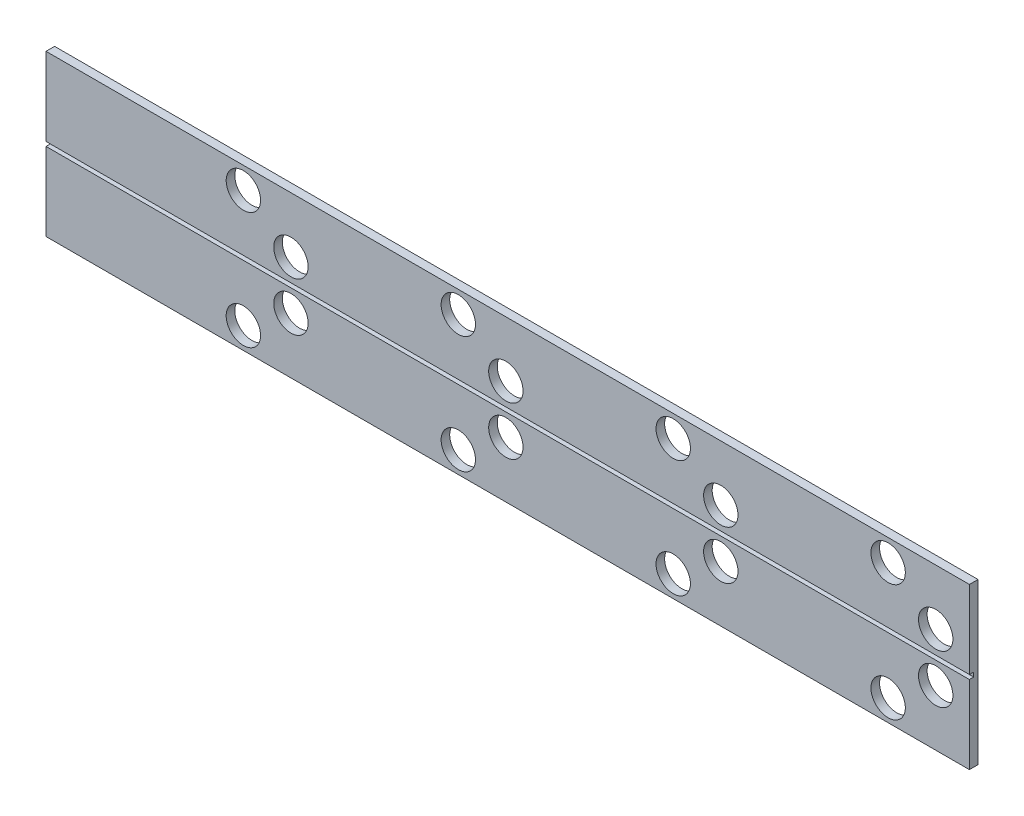
ISO-10303-21;
HEADER;
FILE_DESCRIPTION(('STEP AP214'),'2;1');
FILE_NAME('part.step','',(''),(''),'','','');
FILE_SCHEMA(('AUTOMOTIVE_DESIGN { 1 0 10303 214 1 1 1 1 }'));
ENDSEC;
DATA;
#1=APPLICATION_CONTEXT('core data for automotive mechanical design processes');
#2=APPLICATION_PROTOCOL_DEFINITION('international standard','automotive_design',2000,#1);
#3=PRODUCT_CONTEXT('',#1,'mechanical');
#4=PRODUCT('Part','Part','',(#3));
#5=PRODUCT_RELATED_PRODUCT_CATEGORY('part','',(#4));
#6=PRODUCT_DEFINITION_FORMATION('','',#4);
#7=PRODUCT_DEFINITION_CONTEXT('part definition',#1,'design');
#8=PRODUCT_DEFINITION('design','',#6,#7);
#9=PRODUCT_DEFINITION_SHAPE('','',#8);
#10=(LENGTH_UNIT() NAMED_UNIT(*) SI_UNIT(.MILLI.,.METRE.));
#11=(NAMED_UNIT(*) PLANE_ANGLE_UNIT() SI_UNIT($,.RADIAN.));
#12=(NAMED_UNIT(*) SI_UNIT($,.STERADIAN.) SOLID_ANGLE_UNIT());
#13=UNCERTAINTY_MEASURE_WITH_UNIT(LENGTH_MEASURE(1.E-05),#10,'distance_accuracy_value','');
#14=(GEOMETRIC_REPRESENTATION_CONTEXT(3) GLOBAL_UNCERTAINTY_ASSIGNED_CONTEXT((#13)) GLOBAL_UNIT_ASSIGNED_CONTEXT((#10,
#11,#12)) REPRESENTATION_CONTEXT('',''));
#15=CARTESIAN_POINT('',(0.,0.,0.));
#16=DIRECTION('',(0.,0.,1.));
#17=DIRECTION('',(1.,0.,0.));
#18=AXIS2_PLACEMENT_3D('',#15,#16,#17);
#19=CARTESIAN_POINT('',(0.,0.,0.2));
#20=DIRECTION('',(0.,0.,1.));
#21=DIRECTION('',(1.,0.,0.));
#22=AXIS2_PLACEMENT_3D('',#19,#20,#21);
#23=PLANE('',#22);
#24=CARTESIAN_POINT('',(-6.14935824448216,1.35966981169838,0.2));
#25=DIRECTION('',(0.,0.,1.));
#26=DIRECTION('',(1.,0.,0.));
#27=AXIS2_PLACEMENT_3D('',#24,#25,#26);
#28=CIRCLE('',#27,0.400000000000001);
#29=CARTESIAN_POINT('',(-5.74935824448216,1.35966981169838,0.2));
#30=VERTEX_POINT('',#29);
#31=EDGE_CURVE('E485',#30,#30,#28,.T.);
#32=ORIENTED_EDGE('',*,*,#31,.F.);
#33=EDGE_LOOP('',(#32));
#34=FACE_BOUND('',#33,.T.);
#35=CARTESIAN_POINT('',(-5.04281811205357,0.571259967343007,0.2));
#36=DIRECTION('',(0.,0.,1.));
#37=DIRECTION('',(1.,0.,0.));
#38=AXIS2_PLACEMENT_3D('',#35,#36,#37);
#39=CIRCLE('',#38,0.4);
#40=CARTESIAN_POINT('',(-4.64281811205357,0.571259967343007,0.2));
#41=VERTEX_POINT('',#40);
#42=EDGE_CURVE('E487',#41,#41,#39,.T.);
#43=ORIENTED_EDGE('',*,*,#42,.F.);
#44=EDGE_LOOP('',(#43));
#45=FACE_BOUND('',#44,.T.);
#46=CARTESIAN_POINT('',(-1.14935824448216,1.35966981169838,0.2));
#47=DIRECTION('',(0.,0.,1.));
#48=DIRECTION('',(1.,0.,0.));
#49=AXIS2_PLACEMENT_3D('',#46,#47,#48);
#50=CIRCLE('',#49,0.400000000000001);
#51=CARTESIAN_POINT('',(-0.749358244482159,1.35966981169838,0.2));
#52=VERTEX_POINT('',#51);
#53=EDGE_CURVE('E499',#52,#52,#50,.T.);
#54=ORIENTED_EDGE('',*,*,#53,.F.);
#55=EDGE_LOOP('',(#54));
#56=FACE_BOUND('',#55,.T.);
#57=CARTESIAN_POINT('',(-0.0428181120535696,0.571259967343007,0.2));
#58=DIRECTION('',(0.,0.,1.));
#59=DIRECTION('',(1.,0.,0.));
#60=AXIS2_PLACEMENT_3D('',#57,#58,#59);
#61=CIRCLE('',#60,0.4);
#62=CARTESIAN_POINT('',(0.35718188794643,0.571259967343007,0.2));
#63=VERTEX_POINT('',#62);
#64=EDGE_CURVE('E503',#63,#63,#61,.T.);
#65=ORIENTED_EDGE('',*,*,#64,.F.);
#66=EDGE_LOOP('',(#65));
#67=FACE_BOUND('',#66,.T.);
#68=CARTESIAN_POINT('',(3.85064175551784,1.35966981169838,0.2));
#69=DIRECTION('',(0.,0.,1.));
#70=DIRECTION('',(1.,0.,0.));
#71=AXIS2_PLACEMENT_3D('',#68,#69,#70);
#72=CIRCLE('',#71,0.400000000000001);
#73=CARTESIAN_POINT('',(4.25064175551784,1.35966981169838,0.2));
#74=VERTEX_POINT('',#73);
#75=EDGE_CURVE('E515',#74,#74,#72,.T.);
#76=ORIENTED_EDGE('',*,*,#75,.F.);
#77=EDGE_LOOP('',(#76));
#78=FACE_BOUND('',#77,.T.);
#79=CARTESIAN_POINT('',(4.95718188794643,0.571259967343007,0.2));
#80=DIRECTION('',(0.,0.,1.));
#81=DIRECTION('',(1.,0.,0.));
#82=AXIS2_PLACEMENT_3D('',#79,#80,#81);
#83=CIRCLE('',#82,0.4);
#84=CARTESIAN_POINT('',(5.35718188794643,0.571259967343007,0.2));
#85=VERTEX_POINT('',#84);
#86=EDGE_CURVE('E519',#85,#85,#83,.T.);
#87=ORIENTED_EDGE('',*,*,#86,.F.);
#88=EDGE_LOOP('',(#87));
#89=FACE_BOUND('',#88,.T.);
#90=CARTESIAN_POINT('',(8.85064175551784,1.35966981169838,0.2));
#91=DIRECTION('',(0.,0.,1.));
#92=DIRECTION('',(1.,0.,0.));
#93=AXIS2_PLACEMENT_3D('',#90,#91,#92);
#94=CIRCLE('',#93,0.400000000000001);
#95=CARTESIAN_POINT('',(9.25064175551784,1.35966981169838,0.2));
#96=VERTEX_POINT('',#95);
#97=EDGE_CURVE('E531',#96,#96,#94,.T.);
#98=ORIENTED_EDGE('',*,*,#97,.F.);
#99=EDGE_LOOP('',(#98));
#100=FACE_BOUND('',#99,.T.);
#101=CARTESIAN_POINT('',(9.95718188794643,0.571259967343007,0.2));
#102=DIRECTION('',(0.,0.,1.));
#103=DIRECTION('',(1.,0.,0.));
#104=AXIS2_PLACEMENT_3D('',#101,#102,#103);
#105=CIRCLE('',#104,0.4);
#106=CARTESIAN_POINT('',(10.3571818879464,0.571259967343007,0.2));
#107=VERTEX_POINT('',#106);
#108=EDGE_CURVE('E535',#107,#107,#105,.T.);
#109=ORIENTED_EDGE('',*,*,#108,.F.);
#110=EDGE_LOOP('',(#109));
#111=FACE_BOUND('',#110,.T.);
#112=DIRECTION('',(-1.,0.,0.));
#113=VECTOR('',#112,1.);
#114=CARTESIAN_POINT('',(10.7410625976883,0.05,0.2));
#115=LINE('',#114,#113);
#116=CARTESIAN_POINT('',(10.7410625976883,0.05,0.2));
#117=VERTEX_POINT('',#116);
#118=CARTESIAN_POINT('',(-10.7410625976883,0.05,0.2));
#119=VERTEX_POINT('',#118);
#120=EDGE_CURVE('E124',#117,#119,#115,.T.);
#121=ORIENTED_EDGE('',*,*,#120,.F.);
#122=DIRECTION('',(0.,1.,0.));
#123=VECTOR('',#122,1.);
#124=CARTESIAN_POINT('',(10.7410625976883,1.86597544762487,0.2));
#125=LINE('',#124,#123);
#126=CARTESIAN_POINT('',(10.7410625976883,1.86597544762487,0.2));
#127=VERTEX_POINT('',#126);
#128=EDGE_CURVE('E86',#117,#127,#125,.T.);
#129=ORIENTED_EDGE('',*,*,#128,.T.);
#130=DIRECTION('',(-1.,0.,0.));
#131=VECTOR('',#130,1.);
#132=CARTESIAN_POINT('',(-10.7410625976883,1.86597544762487,0.2));
#133=LINE('',#132,#131);
#134=CARTESIAN_POINT('',(-10.7410625976883,1.86597544762487,0.2));
#135=VERTEX_POINT('',#134);
#136=EDGE_CURVE('E138',#127,#135,#133,.T.);
#137=ORIENTED_EDGE('',*,*,#136,.T.);
#138=DIRECTION('',(0.,-1.,0.));
#139=VECTOR('',#138,1.);
#140=CARTESIAN_POINT('',(-10.7410625976883,1.86597544762487,0.2));
#141=LINE('',#140,#139);
#142=EDGE_CURVE('E140',#135,#119,#141,.T.);
#143=ORIENTED_EDGE('',*,*,#142,.T.);
#144=EDGE_LOOP('',(#121,#129,#137,#143));
#145=FACE_BOUND('',#144,.T.);
#146=ADVANCED_FACE('F33',(#34,#45,#56,#67,#78,#89,#100,#111,#145),#23,.T.);
#147=CARTESIAN_POINT('',(10.7410625976883,1.86597544762487,0.2));
#148=DIRECTION('',(-1.,0.,0.));
#149=DIRECTION('',(0.,0.,1.));
#150=AXIS2_PLACEMENT_3D('',#147,#148,#149);
#151=PLANE('',#150);
#152=ORIENTED_EDGE('',*,*,#128,.F.);
#153=DIRECTION('',(0.,0.,1.));
#154=VECTOR('',#153,1.);
#155=CARTESIAN_POINT('',(10.7410625976883,0.05,0.1));
#156=LINE('',#155,#154);
#157=CARTESIAN_POINT('',(10.7410625976883,0.05,0.1));
#158=VERTEX_POINT('',#157);
#159=EDGE_CURVE('E131',#158,#117,#156,.T.);
#160=ORIENTED_EDGE('',*,*,#159,.F.);
#161=DIRECTION('',(0.,1.,0.));
#162=VECTOR('',#161,1.);
#163=CARTESIAN_POINT('',(10.7410625976883,-0.05,0.1));
#164=LINE('',#163,#162);
#165=CARTESIAN_POINT('',(10.7410625976883,-0.05,0.1));
#166=VERTEX_POINT('',#165);
#167=EDGE_CURVE('E114',#166,#158,#164,.T.);
#168=ORIENTED_EDGE('',*,*,#167,.F.);
#169=DIRECTION('',(0.,0.,1.));
#170=VECTOR('',#169,1.);
#171=CARTESIAN_POINT('',(10.7410625976883,-0.05,0.1));
#172=LINE('',#171,#170);
#173=CARTESIAN_POINT('',(10.7410625976883,-0.05,0.2));
#174=VERTEX_POINT('',#173);
#175=EDGE_CURVE('E111',#166,#174,#172,.T.);
#176=ORIENTED_EDGE('',*,*,#175,.T.);
#177=CARTESIAN_POINT('',(10.7410625976883,-1.86597544762487,0.2));
#178=VERTEX_POINT('',#177);
#179=EDGE_CURVE('E136',#178,#174,#125,.T.);
#180=ORIENTED_EDGE('',*,*,#179,.F.);
#181=DIRECTION('',(0.,0.,-1.));
#182=VECTOR('',#181,1.);
#183=CARTESIAN_POINT('',(10.7410625976883,-1.86597544762487,0.2));
#184=LINE('',#183,#182);
#185=CARTESIAN_POINT('',(10.7410625976883,-1.86597544762487,0.));
#186=VERTEX_POINT('',#185);
#187=EDGE_CURVE('E144',#178,#186,#184,.T.);
#188=ORIENTED_EDGE('',*,*,#187,.T.);
#189=DIRECTION('',(0.,1.,0.));
#190=VECTOR('',#189,1.);
#191=CARTESIAN_POINT('',(10.7410625976883,1.86597544762487,0.));
#192=LINE('',#191,#190);
#193=CARTESIAN_POINT('',(10.7410625976883,1.86597544762487,0.));
#194=VERTEX_POINT('',#193);
#195=EDGE_CURVE('E145',#186,#194,#192,.T.);
#196=ORIENTED_EDGE('',*,*,#195,.T.);
#197=DIRECTION('',(0.,0.,-1.));
#198=VECTOR('',#197,1.);
#199=CARTESIAN_POINT('',(10.7410625976883,1.86597544762487,0.2));
#200=LINE('',#199,#198);
#201=EDGE_CURVE('E11',#127,#194,#200,.T.);
#202=ORIENTED_EDGE('',*,*,#201,.F.);
#203=EDGE_LOOP('',(#152,#160,#168,#176,#180,#188,#196,#202));
#204=FACE_BOUND('',#203,.T.);
#205=ADVANCED_FACE('F35',(#204),#151,.F.);
#206=CARTESIAN_POINT('',(-10.7410625976883,1.86597544762487,0.2));
#207=DIRECTION('',(0.,-1.,0.));
#208=DIRECTION('',(0.,0.,-1.));
#209=AXIS2_PLACEMENT_3D('',#206,#207,#208);
#210=PLANE('',#209);
#211=DIRECTION('',(-1.,0.,0.));
#212=VECTOR('',#211,1.);
#213=CARTESIAN_POINT('',(-10.7410625976883,1.86597544762487,0.));
#214=LINE('',#213,#212);
#215=CARTESIAN_POINT('',(-10.7410625976883,1.86597544762487,0.));
#216=VERTEX_POINT('',#215);
#217=EDGE_CURVE('E148',#194,#216,#214,.T.);
#218=ORIENTED_EDGE('',*,*,#217,.T.);
#219=DIRECTION('',(0.,0.,-1.));
#220=VECTOR('',#219,1.);
#221=CARTESIAN_POINT('',(-10.7410625976883,1.86597544762487,0.2));
#222=LINE('',#221,#220);
#223=EDGE_CURVE('E41',#135,#216,#222,.T.);
#224=ORIENTED_EDGE('',*,*,#223,.F.);
#225=ORIENTED_EDGE('',*,*,#136,.F.);
#226=ORIENTED_EDGE('',*,*,#201,.T.);
#227=EDGE_LOOP('',(#218,#224,#225,#226));
#228=FACE_BOUND('',#227,.T.);
#229=ADVANCED_FACE('F177',(#228),#210,.F.);
#230=CARTESIAN_POINT('',(-10.7410625976883,1.86597544762487,0.2));
#231=DIRECTION('',(1.,0.,0.));
#232=DIRECTION('',(0.,0.,-1.));
#233=AXIS2_PLACEMENT_3D('',#230,#231,#232);
#234=PLANE('',#233);
#235=DIRECTION('',(0.,-1.,0.));
#236=VECTOR('',#235,1.);
#237=CARTESIAN_POINT('',(-10.7410625976883,-0.05,0.1));
#238=LINE('',#237,#236);
#239=CARTESIAN_POINT('',(-10.7410625976883,0.05,0.1));
#240=VERTEX_POINT('',#239);
#241=CARTESIAN_POINT('',(-10.7410625976883,-0.05,0.1));
#242=VERTEX_POINT('',#241);
#243=EDGE_CURVE('E115',#240,#242,#238,.T.);
#244=ORIENTED_EDGE('',*,*,#243,.F.);
#245=DIRECTION('',(0.,0.,1.));
#246=VECTOR('',#245,1.);
#247=CARTESIAN_POINT('',(-10.7410625976883,0.05,0.1));
#248=LINE('',#247,#246);
#249=EDGE_CURVE('E149',#240,#119,#248,.T.);
#250=ORIENTED_EDGE('',*,*,#249,.T.);
#251=ORIENTED_EDGE('',*,*,#142,.F.);
#252=ORIENTED_EDGE('',*,*,#223,.T.);
#253=DIRECTION('',(0.,-1.,0.));
#254=VECTOR('',#253,1.);
#255=CARTESIAN_POINT('',(-10.7410625976883,1.86597544762487,0.));
#256=LINE('',#255,#254);
#257=CARTESIAN_POINT('',(-10.7410625976883,-1.86597544762487,0.));
#258=VERTEX_POINT('',#257);
#259=EDGE_CURVE('E151',#216,#258,#256,.T.);
#260=ORIENTED_EDGE('',*,*,#259,.T.);
#261=DIRECTION('',(0.,0.,-1.));
#262=VECTOR('',#261,1.);
#263=CARTESIAN_POINT('',(-10.7410625976883,-1.86597544762487,0.2));
#264=LINE('',#263,#262);
#265=CARTESIAN_POINT('',(-10.7410625976883,-1.86597544762487,0.2));
#266=VERTEX_POINT('',#265);
#267=EDGE_CURVE('E155',#266,#258,#264,.T.);
#268=ORIENTED_EDGE('',*,*,#267,.F.);
#269=CARTESIAN_POINT('',(-10.7410625976883,-0.0499999999999999,0.2));
#270=VERTEX_POINT('',#269);
#271=EDGE_CURVE('E129',#270,#266,#141,.T.);
#272=ORIENTED_EDGE('',*,*,#271,.F.);
#273=DIRECTION('',(0.,0.,1.));
#274=VECTOR('',#273,1.);
#275=CARTESIAN_POINT('',(-10.7410625976883,-0.05,0.1));
#276=LINE('',#275,#274);
#277=EDGE_CURVE('E48',#242,#270,#276,.T.);
#278=ORIENTED_EDGE('',*,*,#277,.F.);
#279=EDGE_LOOP('',(#244,#250,#251,#252,#260,#268,#272,#278));
#280=FACE_BOUND('',#279,.T.);
#281=ADVANCED_FACE('F127',(#280),#234,.F.);
#282=CARTESIAN_POINT('',(-10.7410625976883,-1.86597544762487,0.2));
#283=DIRECTION('',(0.,1.,0.));
#284=DIRECTION('',(0.,0.,1.));
#285=AXIS2_PLACEMENT_3D('',#282,#283,#284);
#286=PLANE('',#285);
#287=DIRECTION('',(1.,0.,0.));
#288=VECTOR('',#287,1.);
#289=CARTESIAN_POINT('',(-10.7410625976883,-1.86597544762487,0.));
#290=LINE('',#289,#288);
#291=EDGE_CURVE('E78',#258,#186,#290,.T.);
#292=ORIENTED_EDGE('',*,*,#291,.T.);
#293=ORIENTED_EDGE('',*,*,#187,.F.);
#294=DIRECTION('',(1.,0.,0.));
#295=VECTOR('',#294,1.);
#296=CARTESIAN_POINT('',(-10.7410625976883,-1.86597544762487,0.2));
#297=LINE('',#296,#295);
#298=EDGE_CURVE('E57',#266,#178,#297,.T.);
#299=ORIENTED_EDGE('',*,*,#298,.F.);
#300=ORIENTED_EDGE('',*,*,#267,.T.);
#301=EDGE_LOOP('',(#292,#293,#299,#300));
#302=FACE_BOUND('',#301,.T.);
#303=ADVANCED_FACE('F167',(#302),#286,.F.);
#304=CARTESIAN_POINT('',(-6.14935824448216,-1.36518526440703,0.2));
#305=DIRECTION('',(0.,0.,1.));
#306=DIRECTION('',(1.,0.,0.));
#307=AXIS2_PLACEMENT_3D('',#304,#305,#306);
#308=CIRCLE('',#307,0.400000000000001);
#309=CARTESIAN_POINT('',(-5.74935824448216,-1.36518526440703,0.2));
#310=VERTEX_POINT('',#309);
#311=EDGE_CURVE('E491',#310,#310,#308,.T.);
#312=ORIENTED_EDGE('',*,*,#311,.F.);
#313=EDGE_LOOP('',(#312));
#314=FACE_BOUND('',#313,.T.);
#315=CARTESIAN_POINT('',(-5.04281811205357,-0.562943668396298,0.2));
#316=DIRECTION('',(0.,0.,1.));
#317=DIRECTION('',(1.,0.,0.));
#318=AXIS2_PLACEMENT_3D('',#315,#316,#317);
#319=CIRCLE('',#318,0.4);
#320=CARTESIAN_POINT('',(-4.64281811205357,-0.562943668396298,0.2));
#321=VERTEX_POINT('',#320);
#322=EDGE_CURVE('E495',#321,#321,#319,.T.);
#323=ORIENTED_EDGE('',*,*,#322,.F.);
#324=EDGE_LOOP('',(#323));
#325=FACE_BOUND('',#324,.T.);
#326=CARTESIAN_POINT('',(-1.14935824448216,-1.36518526440703,0.2));
#327=DIRECTION('',(0.,0.,1.));
#328=DIRECTION('',(1.,0.,0.));
#329=AXIS2_PLACEMENT_3D('',#326,#327,#328);
#330=CIRCLE('',#329,0.400000000000001);
#331=CARTESIAN_POINT('',(-0.749358244482159,-1.36518526440703,0.2));
#332=VERTEX_POINT('',#331);
#333=EDGE_CURVE('E507',#332,#332,#330,.T.);
#334=ORIENTED_EDGE('',*,*,#333,.F.);
#335=EDGE_LOOP('',(#334));
#336=FACE_BOUND('',#335,.T.);
#337=CARTESIAN_POINT('',(-0.0428181120535696,-0.562943668396298,0.2));
#338=DIRECTION('',(0.,0.,1.));
#339=DIRECTION('',(1.,0.,0.));
#340=AXIS2_PLACEMENT_3D('',#337,#338,#339);
#341=CIRCLE('',#340,0.4);
#342=CARTESIAN_POINT('',(0.35718188794643,-0.562943668396298,0.2));
#343=VERTEX_POINT('',#342);
#344=EDGE_CURVE('E511',#343,#343,#341,.T.);
#345=ORIENTED_EDGE('',*,*,#344,.F.);
#346=EDGE_LOOP('',(#345));
#347=FACE_BOUND('',#346,.T.);
#348=CARTESIAN_POINT('',(3.85064175551784,-1.36518526440703,0.2));
#349=DIRECTION('',(0.,0.,1.));
#350=DIRECTION('',(1.,0.,0.));
#351=AXIS2_PLACEMENT_3D('',#348,#349,#350);
#352=CIRCLE('',#351,0.400000000000001);
#353=CARTESIAN_POINT('',(4.25064175551784,-1.36518526440703,0.2));
#354=VERTEX_POINT('',#353);
#355=EDGE_CURVE('E523',#354,#354,#352,.T.);
#356=ORIENTED_EDGE('',*,*,#355,.F.);
#357=EDGE_LOOP('',(#356));
#358=FACE_BOUND('',#357,.T.);
#359=CARTESIAN_POINT('',(4.95718188794643,-0.562943668396298,0.2));
#360=DIRECTION('',(0.,0.,1.));
#361=DIRECTION('',(1.,0.,0.));
#362=AXIS2_PLACEMENT_3D('',#359,#360,#361);
#363=CIRCLE('',#362,0.4);
#364=CARTESIAN_POINT('',(5.35718188794643,-0.562943668396298,0.2));
#365=VERTEX_POINT('',#364);
#366=EDGE_CURVE('E527',#365,#365,#363,.T.);
#367=ORIENTED_EDGE('',*,*,#366,.F.);
#368=EDGE_LOOP('',(#367));
#369=FACE_BOUND('',#368,.T.);
#370=CARTESIAN_POINT('',(8.85064175551784,-1.36518526440703,0.2));
#371=DIRECTION('',(0.,0.,1.));
#372=DIRECTION('',(1.,0.,0.));
#373=AXIS2_PLACEMENT_3D('',#370,#371,#372);
#374=CIRCLE('',#373,0.400000000000001);
#375=CARTESIAN_POINT('',(9.25064175551784,-1.36518526440703,0.2));
#376=VERTEX_POINT('',#375);
#377=EDGE_CURVE('E267',#376,#376,#374,.T.);
#378=ORIENTED_EDGE('',*,*,#377,.F.);
#379=EDGE_LOOP('',(#378));
#380=FACE_BOUND('',#379,.T.);
#381=CARTESIAN_POINT('',(9.95718188794643,-0.562943668396298,0.2));
#382=DIRECTION('',(0.,0.,1.));
#383=DIRECTION('',(1.,0.,0.));
#384=AXIS2_PLACEMENT_3D('',#381,#382,#383);
#385=CIRCLE('',#384,0.4);
#386=CARTESIAN_POINT('',(10.3571818879464,-0.562943668396298,0.2));
#387=VERTEX_POINT('',#386);
#388=EDGE_CURVE('E261',#387,#387,#385,.T.);
#389=ORIENTED_EDGE('',*,*,#388,.F.);
#390=EDGE_LOOP('',(#389));
#391=FACE_BOUND('',#390,.T.);
#392=DIRECTION('',(1.,0.,0.));
#393=VECTOR('',#392,1.);
#394=CARTESIAN_POINT('',(10.7410625976883,-0.05,0.2));
#395=LINE('',#394,#393);
#396=EDGE_CURVE('E260',#270,#174,#395,.T.);
#397=ORIENTED_EDGE('',*,*,#396,.F.);
#398=ORIENTED_EDGE('',*,*,#271,.T.);
#399=ORIENTED_EDGE('',*,*,#298,.T.);
#400=ORIENTED_EDGE('',*,*,#179,.T.);
#401=EDGE_LOOP('',(#397,#398,#399,#400));
#402=FACE_BOUND('',#401,.T.);
#403=ADVANCED_FACE('F169',(#314,#325,#336,#347,#358,#369,#380,#391,#402),#23,.T.);
#404=CARTESIAN_POINT('',(0.,0.,0.));
#405=DIRECTION('',(0.,0.,1.));
#406=DIRECTION('',(1.,0.,0.));
#407=AXIS2_PLACEMENT_3D('',#404,#405,#406);
#408=PLANE('',#407);
#409=CARTESIAN_POINT('',(-6.14935824448216,1.35966981169838,0.));
#410=DIRECTION('',(0.,0.,1.));
#411=DIRECTION('',(1.,0.,0.));
#412=AXIS2_PLACEMENT_3D('',#409,#410,#411);
#413=CIRCLE('',#412,0.400000000000001);
#414=CARTESIAN_POINT('',(-5.74935824448216,1.35966981169838,0.));
#415=VERTEX_POINT('',#414);
#416=EDGE_CURVE('E199',#415,#415,#413,.T.);
#417=ORIENTED_EDGE('',*,*,#416,.T.);
#418=EDGE_LOOP('',(#417));
#419=FACE_BOUND('',#418,.T.);
#420=CARTESIAN_POINT('',(-5.04281811205357,0.571259967343007,0.));
#421=DIRECTION('',(0.,0.,1.));
#422=DIRECTION('',(1.,0.,0.));
#423=AXIS2_PLACEMENT_3D('',#420,#421,#422);
#424=CIRCLE('',#423,0.4);
#425=CARTESIAN_POINT('',(-4.64281811205357,0.571259967343007,0.));
#426=VERTEX_POINT('',#425);
#427=EDGE_CURVE('E203',#426,#426,#424,.T.);
#428=ORIENTED_EDGE('',*,*,#427,.T.);
#429=EDGE_LOOP('',(#428));
#430=FACE_BOUND('',#429,.T.);
#431=CARTESIAN_POINT('',(-6.14935824448216,-1.36518526440703,0.));
#432=DIRECTION('',(0.,0.,1.));
#433=DIRECTION('',(1.,0.,0.));
#434=AXIS2_PLACEMENT_3D('',#431,#432,#433);
#435=CIRCLE('',#434,0.400000000000001);
#436=CARTESIAN_POINT('',(-5.74935824448216,-1.36518526440703,0.));
#437=VERTEX_POINT('',#436);
#438=EDGE_CURVE('E207',#437,#437,#435,.T.);
#439=ORIENTED_EDGE('',*,*,#438,.T.);
#440=EDGE_LOOP('',(#439));
#441=FACE_BOUND('',#440,.T.);
#442=CARTESIAN_POINT('',(-5.04281811205357,-0.562943668396298,0.));
#443=DIRECTION('',(0.,0.,1.));
#444=DIRECTION('',(1.,0.,0.));
#445=AXIS2_PLACEMENT_3D('',#442,#443,#444);
#446=CIRCLE('',#445,0.4);
#447=CARTESIAN_POINT('',(-4.64281811205357,-0.562943668396298,0.));
#448=VERTEX_POINT('',#447);
#449=EDGE_CURVE('E211',#448,#448,#446,.T.);
#450=ORIENTED_EDGE('',*,*,#449,.T.);
#451=EDGE_LOOP('',(#450));
#452=FACE_BOUND('',#451,.T.);
#453=CARTESIAN_POINT('',(-1.14935824448216,1.35966981169838,0.));
#454=DIRECTION('',(0.,0.,1.));
#455=DIRECTION('',(1.,0.,0.));
#456=AXIS2_PLACEMENT_3D('',#453,#454,#455);
#457=CIRCLE('',#456,0.400000000000001);
#458=CARTESIAN_POINT('',(-0.749358244482159,1.35966981169838,0.));
#459=VERTEX_POINT('',#458);
#460=EDGE_CURVE('E215',#459,#459,#457,.T.);
#461=ORIENTED_EDGE('',*,*,#460,.T.);
#462=EDGE_LOOP('',(#461));
#463=FACE_BOUND('',#462,.T.);
#464=CARTESIAN_POINT('',(-0.0428181120535696,0.571259967343007,0.));
#465=DIRECTION('',(0.,0.,1.));
#466=DIRECTION('',(1.,0.,0.));
#467=AXIS2_PLACEMENT_3D('',#464,#465,#466);
#468=CIRCLE('',#467,0.4);
#469=CARTESIAN_POINT('',(0.35718188794643,0.571259967343007,0.));
#470=VERTEX_POINT('',#469);
#471=EDGE_CURVE('E219',#470,#470,#468,.T.);
#472=ORIENTED_EDGE('',*,*,#471,.T.);
#473=EDGE_LOOP('',(#472));
#474=FACE_BOUND('',#473,.T.);
#475=CARTESIAN_POINT('',(-1.14935824448216,-1.36518526440703,0.));
#476=DIRECTION('',(0.,0.,1.));
#477=DIRECTION('',(1.,0.,0.));
#478=AXIS2_PLACEMENT_3D('',#475,#476,#477);
#479=CIRCLE('',#478,0.400000000000001);
#480=CARTESIAN_POINT('',(-0.749358244482159,-1.36518526440703,0.));
#481=VERTEX_POINT('',#480);
#482=EDGE_CURVE('E223',#481,#481,#479,.T.);
#483=ORIENTED_EDGE('',*,*,#482,.T.);
#484=EDGE_LOOP('',(#483));
#485=FACE_BOUND('',#484,.T.);
#486=CARTESIAN_POINT('',(-0.0428181120535696,-0.562943668396298,0.));
#487=DIRECTION('',(0.,0.,1.));
#488=DIRECTION('',(1.,0.,0.));
#489=AXIS2_PLACEMENT_3D('',#486,#487,#488);
#490=CIRCLE('',#489,0.4);
#491=CARTESIAN_POINT('',(0.35718188794643,-0.562943668396298,0.));
#492=VERTEX_POINT('',#491);
#493=EDGE_CURVE('E227',#492,#492,#490,.T.);
#494=ORIENTED_EDGE('',*,*,#493,.T.);
#495=EDGE_LOOP('',(#494));
#496=FACE_BOUND('',#495,.T.);
#497=CARTESIAN_POINT('',(3.85064175551784,1.35966981169838,0.));
#498=DIRECTION('',(0.,0.,1.));
#499=DIRECTION('',(1.,0.,0.));
#500=AXIS2_PLACEMENT_3D('',#497,#498,#499);
#501=CIRCLE('',#500,0.400000000000001);
#502=CARTESIAN_POINT('',(4.25064175551784,1.35966981169838,0.));
#503=VERTEX_POINT('',#502);
#504=EDGE_CURVE('E231',#503,#503,#501,.T.);
#505=ORIENTED_EDGE('',*,*,#504,.T.);
#506=EDGE_LOOP('',(#505));
#507=FACE_BOUND('',#506,.T.);
#508=CARTESIAN_POINT('',(4.95718188794643,0.571259967343007,0.));
#509=DIRECTION('',(0.,0.,1.));
#510=DIRECTION('',(1.,0.,0.));
#511=AXIS2_PLACEMENT_3D('',#508,#509,#510);
#512=CIRCLE('',#511,0.4);
#513=CARTESIAN_POINT('',(5.35718188794643,0.571259967343007,0.));
#514=VERTEX_POINT('',#513);
#515=EDGE_CURVE('E235',#514,#514,#512,.T.);
#516=ORIENTED_EDGE('',*,*,#515,.T.);
#517=EDGE_LOOP('',(#516));
#518=FACE_BOUND('',#517,.T.);
#519=CARTESIAN_POINT('',(3.85064175551784,-1.36518526440703,0.));
#520=DIRECTION('',(0.,0.,1.));
#521=DIRECTION('',(1.,0.,0.));
#522=AXIS2_PLACEMENT_3D('',#519,#520,#521);
#523=CIRCLE('',#522,0.400000000000001);
#524=CARTESIAN_POINT('',(4.25064175551784,-1.36518526440703,0.));
#525=VERTEX_POINT('',#524);
#526=EDGE_CURVE('E239',#525,#525,#523,.T.);
#527=ORIENTED_EDGE('',*,*,#526,.T.);
#528=EDGE_LOOP('',(#527));
#529=FACE_BOUND('',#528,.T.);
#530=CARTESIAN_POINT('',(4.95718188794643,-0.562943668396298,0.));
#531=DIRECTION('',(0.,0.,1.));
#532=DIRECTION('',(1.,0.,0.));
#533=AXIS2_PLACEMENT_3D('',#530,#531,#532);
#534=CIRCLE('',#533,0.4);
#535=CARTESIAN_POINT('',(5.35718188794643,-0.562943668396298,0.));
#536=VERTEX_POINT('',#535);
#537=EDGE_CURVE('E243',#536,#536,#534,.T.);
#538=ORIENTED_EDGE('',*,*,#537,.T.);
#539=EDGE_LOOP('',(#538));
#540=FACE_BOUND('',#539,.T.);
#541=CARTESIAN_POINT('',(8.85064175551784,1.35966981169838,0.));
#542=DIRECTION('',(0.,0.,1.));
#543=DIRECTION('',(1.,0.,0.));
#544=AXIS2_PLACEMENT_3D('',#541,#542,#543);
#545=CIRCLE('',#544,0.400000000000001);
#546=CARTESIAN_POINT('',(9.25064175551784,1.35966981169838,0.));
#547=VERTEX_POINT('',#546);
#548=EDGE_CURVE('E247',#547,#547,#545,.T.);
#549=ORIENTED_EDGE('',*,*,#548,.T.);
#550=EDGE_LOOP('',(#549));
#551=FACE_BOUND('',#550,.T.);
#552=CARTESIAN_POINT('',(9.95718188794643,0.571259967343007,0.));
#553=DIRECTION('',(0.,0.,1.));
#554=DIRECTION('',(1.,0.,0.));
#555=AXIS2_PLACEMENT_3D('',#552,#553,#554);
#556=CIRCLE('',#555,0.4);
#557=CARTESIAN_POINT('',(10.3571818879464,0.571259967343007,0.));
#558=VERTEX_POINT('',#557);
#559=EDGE_CURVE('E251',#558,#558,#556,.T.);
#560=ORIENTED_EDGE('',*,*,#559,.T.);
#561=EDGE_LOOP('',(#560));
#562=FACE_BOUND('',#561,.T.);
#563=CARTESIAN_POINT('',(8.85064175551784,-1.36518526440703,0.));
#564=DIRECTION('',(0.,0.,1.));
#565=DIRECTION('',(1.,0.,0.));
#566=AXIS2_PLACEMENT_3D('',#563,#564,#565);
#567=CIRCLE('',#566,0.400000000000001);
#568=CARTESIAN_POINT('',(9.25064175551784,-1.36518526440703,0.));
#569=VERTEX_POINT('',#568);
#570=EDGE_CURVE('E255',#569,#569,#567,.T.);
#571=ORIENTED_EDGE('',*,*,#570,.T.);
#572=EDGE_LOOP('',(#571));
#573=FACE_BOUND('',#572,.T.);
#574=CARTESIAN_POINT('',(9.95718188794643,-0.562943668396298,0.));
#575=DIRECTION('',(0.,0.,1.));
#576=DIRECTION('',(1.,0.,0.));
#577=AXIS2_PLACEMENT_3D('',#574,#575,#576);
#578=CIRCLE('',#577,0.4);
#579=CARTESIAN_POINT('',(10.3571818879464,-0.562943668396298,0.));
#580=VERTEX_POINT('',#579);
#581=EDGE_CURVE('E258',#580,#580,#578,.T.);
#582=ORIENTED_EDGE('',*,*,#581,.T.);
#583=EDGE_LOOP('',(#582));
#584=FACE_BOUND('',#583,.T.);
#585=ORIENTED_EDGE('',*,*,#195,.F.);
#586=ORIENTED_EDGE('',*,*,#291,.F.);
#587=ORIENTED_EDGE('',*,*,#259,.F.);
#588=ORIENTED_EDGE('',*,*,#217,.F.);
#589=EDGE_LOOP('',(#585,#586,#587,#588));
#590=FACE_BOUND('',#589,.T.);
#591=ADVANCED_FACE('F163',(#419,#430,#441,#452,#463,#474,#485,#496,#507,#518,#529,#540,#551,
#562,#573,#584,#590),#408,.F.);
#592=CARTESIAN_POINT('',(10.7410625976883,0.05,0.1));
#593=DIRECTION('',(0.,1.,0.));
#594=DIRECTION('',(0.,0.,1.));
#595=AXIS2_PLACEMENT_3D('',#592,#593,#594);
#596=PLANE('',#595);
#597=ORIENTED_EDGE('',*,*,#120,.T.);
#598=ORIENTED_EDGE('',*,*,#249,.F.);
#599=DIRECTION('',(-1.,0.,0.));
#600=VECTOR('',#599,1.);
#601=CARTESIAN_POINT('',(10.7410625976883,0.05,0.1));
#602=LINE('',#601,#600);
#603=EDGE_CURVE('E121',#158,#240,#602,.T.);
#604=ORIENTED_EDGE('',*,*,#603,.F.);
#605=ORIENTED_EDGE('',*,*,#159,.T.);
#606=EDGE_LOOP('',(#597,#598,#604,#605));
#607=FACE_BOUND('',#606,.T.);
#608=ADVANCED_FACE('F190',(#607),#596,.F.);
#609=CARTESIAN_POINT('',(10.7410625976883,-0.05,0.1));
#610=DIRECTION('',(0.,-1.,0.));
#611=DIRECTION('',(0.,0.,-1.));
#612=AXIS2_PLACEMENT_3D('',#609,#610,#611);
#613=PLANE('',#612);
#614=ORIENTED_EDGE('',*,*,#396,.T.);
#615=ORIENTED_EDGE('',*,*,#175,.F.);
#616=DIRECTION('',(1.,0.,0.));
#617=VECTOR('',#616,1.);
#618=CARTESIAN_POINT('',(10.7410625976883,-0.05,0.1));
#619=LINE('',#618,#617);
#620=EDGE_CURVE('E107',#242,#166,#619,.T.);
#621=ORIENTED_EDGE('',*,*,#620,.F.);
#622=ORIENTED_EDGE('',*,*,#277,.T.);
#623=EDGE_LOOP('',(#614,#615,#621,#622));
#624=FACE_BOUND('',#623,.T.);
#625=ADVANCED_FACE('F109',(#624),#613,.F.);
#626=CARTESIAN_POINT('',(0.,0.,0.1));
#627=DIRECTION('',(0.,0.,1.));
#628=DIRECTION('',(1.,0.,0.));
#629=AXIS2_PLACEMENT_3D('',#626,#627,#628);
#630=PLANE('',#629);
#631=ORIENTED_EDGE('',*,*,#243,.T.);
#632=ORIENTED_EDGE('',*,*,#620,.T.);
#633=ORIENTED_EDGE('',*,*,#167,.T.);
#634=ORIENTED_EDGE('',*,*,#603,.T.);
#635=EDGE_LOOP('',(#631,#632,#633,#634));
#636=FACE_BOUND('',#635,.T.);
#637=ADVANCED_FACE('F119',(#636),#630,.T.);
#638=CARTESIAN_POINT('',(9.95718188794643,-0.562943668396298,0.));
#639=DIRECTION('',(0.,0.,1.));
#640=DIRECTION('',(1.,0.,0.));
#641=AXIS2_PLACEMENT_3D('',#638,#639,#640);
#642=CYLINDRICAL_SURFACE('',#641,0.4);
#643=ORIENTED_EDGE('',*,*,#581,.F.);
#644=EDGE_LOOP('',(#643));
#645=FACE_BOUND('',#644,.T.);
#646=ORIENTED_EDGE('',*,*,#388,.T.);
#647=EDGE_LOOP('',(#646));
#648=FACE_BOUND('',#647,.T.);
#649=ADVANCED_FACE('F308',(#645,#648),#642,.F.);
#650=CARTESIAN_POINT('',(8.85064175551784,-1.36518526440703,0.));
#651=DIRECTION('',(0.,0.,1.));
#652=DIRECTION('',(1.,0.,0.));
#653=AXIS2_PLACEMENT_3D('',#650,#651,#652);
#654=CYLINDRICAL_SURFACE('',#653,0.400000000000001);
#655=ORIENTED_EDGE('',*,*,#570,.F.);
#656=EDGE_LOOP('',(#655));
#657=FACE_BOUND('',#656,.T.);
#658=ORIENTED_EDGE('',*,*,#377,.T.);
#659=EDGE_LOOP('',(#658));
#660=FACE_BOUND('',#659,.T.);
#661=ADVANCED_FACE('F317',(#657,#660),#654,.F.);
#662=CARTESIAN_POINT('',(9.95718188794643,0.571259967343007,0.));
#663=DIRECTION('',(0.,0.,1.));
#664=DIRECTION('',(1.,0.,0.));
#665=AXIS2_PLACEMENT_3D('',#662,#663,#664);
#666=CYLINDRICAL_SURFACE('',#665,0.4);
#667=ORIENTED_EDGE('',*,*,#559,.F.);
#668=EDGE_LOOP('',(#667));
#669=FACE_BOUND('',#668,.T.);
#670=ORIENTED_EDGE('',*,*,#108,.T.);
#671=EDGE_LOOP('',(#670));
#672=FACE_BOUND('',#671,.T.);
#673=ADVANCED_FACE('F326',(#669,#672),#666,.F.);
#674=CARTESIAN_POINT('',(8.85064175551784,1.35966981169838,0.));
#675=DIRECTION('',(0.,0.,1.));
#676=DIRECTION('',(1.,0.,0.));
#677=AXIS2_PLACEMENT_3D('',#674,#675,#676);
#678=CYLINDRICAL_SURFACE('',#677,0.400000000000001);
#679=ORIENTED_EDGE('',*,*,#548,.F.);
#680=EDGE_LOOP('',(#679));
#681=FACE_BOUND('',#680,.T.);
#682=ORIENTED_EDGE('',*,*,#97,.T.);
#683=EDGE_LOOP('',(#682));
#684=FACE_BOUND('',#683,.T.);
#685=ADVANCED_FACE('F336',(#681,#684),#678,.F.);
#686=CARTESIAN_POINT('',(4.95718188794643,-0.562943668396298,0.));
#687=DIRECTION('',(0.,0.,1.));
#688=DIRECTION('',(1.,0.,0.));
#689=AXIS2_PLACEMENT_3D('',#686,#687,#688);
#690=CYLINDRICAL_SURFACE('',#689,0.4);
#691=ORIENTED_EDGE('',*,*,#537,.F.);
#692=EDGE_LOOP('',(#691));
#693=FACE_BOUND('',#692,.T.);
#694=ORIENTED_EDGE('',*,*,#366,.T.);
#695=EDGE_LOOP('',(#694));
#696=FACE_BOUND('',#695,.T.);
#697=ADVANCED_FACE('F345',(#693,#696),#690,.F.);
#698=CARTESIAN_POINT('',(3.85064175551784,-1.36518526440703,0.));
#699=DIRECTION('',(0.,0.,1.));
#700=DIRECTION('',(1.,0.,0.));
#701=AXIS2_PLACEMENT_3D('',#698,#699,#700);
#702=CYLINDRICAL_SURFACE('',#701,0.400000000000001);
#703=ORIENTED_EDGE('',*,*,#526,.F.);
#704=EDGE_LOOP('',(#703));
#705=FACE_BOUND('',#704,.T.);
#706=ORIENTED_EDGE('',*,*,#355,.T.);
#707=EDGE_LOOP('',(#706));
#708=FACE_BOUND('',#707,.T.);
#709=ADVANCED_FACE('F369',(#705,#708),#702,.F.);
#710=CARTESIAN_POINT('',(4.95718188794643,0.571259967343007,0.));
#711=DIRECTION('',(0.,0.,1.));
#712=DIRECTION('',(1.,0.,0.));
#713=AXIS2_PLACEMENT_3D('',#710,#711,#712);
#714=CYLINDRICAL_SURFACE('',#713,0.4);
#715=ORIENTED_EDGE('',*,*,#515,.F.);
#716=EDGE_LOOP('',(#715));
#717=FACE_BOUND('',#716,.T.);
#718=ORIENTED_EDGE('',*,*,#86,.T.);
#719=EDGE_LOOP('',(#718));
#720=FACE_BOUND('',#719,.T.);
#721=ADVANCED_FACE('F379',(#717,#720),#714,.F.);
#722=CARTESIAN_POINT('',(3.85064175551784,1.35966981169838,0.));
#723=DIRECTION('',(0.,0.,1.));
#724=DIRECTION('',(1.,0.,0.));
#725=AXIS2_PLACEMENT_3D('',#722,#723,#724);
#726=CYLINDRICAL_SURFACE('',#725,0.400000000000001);
#727=ORIENTED_EDGE('',*,*,#504,.F.);
#728=EDGE_LOOP('',(#727));
#729=FACE_BOUND('',#728,.T.);
#730=ORIENTED_EDGE('',*,*,#75,.T.);
#731=EDGE_LOOP('',(#730));
#732=FACE_BOUND('',#731,.T.);
#733=ADVANCED_FACE('F389',(#729,#732),#726,.F.);
#734=CARTESIAN_POINT('',(-0.0428181120535696,-0.562943668396298,0.));
#735=DIRECTION('',(0.,0.,1.));
#736=DIRECTION('',(1.,0.,0.));
#737=AXIS2_PLACEMENT_3D('',#734,#735,#736);
#738=CYLINDRICAL_SURFACE('',#737,0.4);
#739=ORIENTED_EDGE('',*,*,#493,.F.);
#740=EDGE_LOOP('',(#739));
#741=FACE_BOUND('',#740,.T.);
#742=ORIENTED_EDGE('',*,*,#344,.T.);
#743=EDGE_LOOP('',(#742));
#744=FACE_BOUND('',#743,.T.);
#745=ADVANCED_FACE('F399',(#741,#744),#738,.F.);
#746=CARTESIAN_POINT('',(-1.14935824448216,-1.36518526440703,0.));
#747=DIRECTION('',(0.,0.,1.));
#748=DIRECTION('',(1.,0.,0.));
#749=AXIS2_PLACEMENT_3D('',#746,#747,#748);
#750=CYLINDRICAL_SURFACE('',#749,0.400000000000001);
#751=ORIENTED_EDGE('',*,*,#482,.F.);
#752=EDGE_LOOP('',(#751));
#753=FACE_BOUND('',#752,.T.);
#754=ORIENTED_EDGE('',*,*,#333,.T.);
#755=EDGE_LOOP('',(#754));
#756=FACE_BOUND('',#755,.T.);
#757=ADVANCED_FACE('F409',(#753,#756),#750,.F.);
#758=CARTESIAN_POINT('',(-0.0428181120535696,0.571259967343007,0.));
#759=DIRECTION('',(0.,0.,1.));
#760=DIRECTION('',(1.,0.,0.));
#761=AXIS2_PLACEMENT_3D('',#758,#759,#760);
#762=CYLINDRICAL_SURFACE('',#761,0.4);
#763=ORIENTED_EDGE('',*,*,#471,.F.);
#764=EDGE_LOOP('',(#763));
#765=FACE_BOUND('',#764,.T.);
#766=ORIENTED_EDGE('',*,*,#64,.T.);
#767=EDGE_LOOP('',(#766));
#768=FACE_BOUND('',#767,.T.);
#769=ADVANCED_FACE('F419',(#765,#768),#762,.F.);
#770=CARTESIAN_POINT('',(-1.14935824448216,1.35966981169838,0.));
#771=DIRECTION('',(0.,0.,1.));
#772=DIRECTION('',(1.,0.,0.));
#773=AXIS2_PLACEMENT_3D('',#770,#771,#772);
#774=CYLINDRICAL_SURFACE('',#773,0.400000000000001);
#775=ORIENTED_EDGE('',*,*,#460,.F.);
#776=EDGE_LOOP('',(#775));
#777=FACE_BOUND('',#776,.T.);
#778=ORIENTED_EDGE('',*,*,#53,.T.);
#779=EDGE_LOOP('',(#778));
#780=FACE_BOUND('',#779,.T.);
#781=ADVANCED_FACE('F429',(#777,#780),#774,.F.);
#782=CARTESIAN_POINT('',(-5.04281811205357,-0.562943668396298,0.));
#783=DIRECTION('',(0.,0.,1.));
#784=DIRECTION('',(1.,0.,0.));
#785=AXIS2_PLACEMENT_3D('',#782,#783,#784);
#786=CYLINDRICAL_SURFACE('',#785,0.4);
#787=ORIENTED_EDGE('',*,*,#449,.F.);
#788=EDGE_LOOP('',(#787));
#789=FACE_BOUND('',#788,.T.);
#790=ORIENTED_EDGE('',*,*,#322,.T.);
#791=EDGE_LOOP('',(#790));
#792=FACE_BOUND('',#791,.T.);
#793=ADVANCED_FACE('F439',(#789,#792),#786,.F.);
#794=CARTESIAN_POINT('',(-6.14935824448216,-1.36518526440703,0.));
#795=DIRECTION('',(0.,0.,1.));
#796=DIRECTION('',(1.,0.,0.));
#797=AXIS2_PLACEMENT_3D('',#794,#795,#796);
#798=CYLINDRICAL_SURFACE('',#797,0.400000000000001);
#799=ORIENTED_EDGE('',*,*,#438,.F.);
#800=EDGE_LOOP('',(#799));
#801=FACE_BOUND('',#800,.T.);
#802=ORIENTED_EDGE('',*,*,#311,.T.);
#803=EDGE_LOOP('',(#802));
#804=FACE_BOUND('',#803,.T.);
#805=ADVANCED_FACE('F449',(#801,#804),#798,.F.);
#806=CARTESIAN_POINT('',(-5.04281811205357,0.571259967343007,0.));
#807=DIRECTION('',(0.,0.,1.));
#808=DIRECTION('',(1.,0.,0.));
#809=AXIS2_PLACEMENT_3D('',#806,#807,#808);
#810=CYLINDRICAL_SURFACE('',#809,0.4);
#811=ORIENTED_EDGE('',*,*,#427,.F.);
#812=EDGE_LOOP('',(#811));
#813=FACE_BOUND('',#812,.T.);
#814=ORIENTED_EDGE('',*,*,#42,.T.);
#815=EDGE_LOOP('',(#814));
#816=FACE_BOUND('',#815,.T.);
#817=ADVANCED_FACE('F459',(#813,#816),#810,.F.);
#818=CARTESIAN_POINT('',(-6.14935824448216,1.35966981169838,0.));
#819=DIRECTION('',(0.,0.,1.));
#820=DIRECTION('',(1.,0.,0.));
#821=AXIS2_PLACEMENT_3D('',#818,#819,#820);
#822=CYLINDRICAL_SURFACE('',#821,0.400000000000001);
#823=ORIENTED_EDGE('',*,*,#416,.F.);
#824=EDGE_LOOP('',(#823));
#825=FACE_BOUND('',#824,.T.);
#826=ORIENTED_EDGE('',*,*,#31,.T.);
#827=EDGE_LOOP('',(#826));
#828=FACE_BOUND('',#827,.T.);
#829=ADVANCED_FACE('F469',(#825,#828),#822,.F.);
#830=CLOSED_SHELL('',(#146,#205,#229,#281,#303,#403,#591,#608,#625,#637,#649,#661,#673,#685,
#697,#709,#721,#733,#745,#757,#769,#781,#793,#805,#817,#829));
#831=MANIFOLD_SOLID_BREP('B2',#830);
#832=ADVANCED_BREP_SHAPE_REPRESENTATION('',(#18,#831),#14);
#833=SHAPE_DEFINITION_REPRESENTATION(#9,#832);
ENDSEC;
END-ISO-10303-21;
